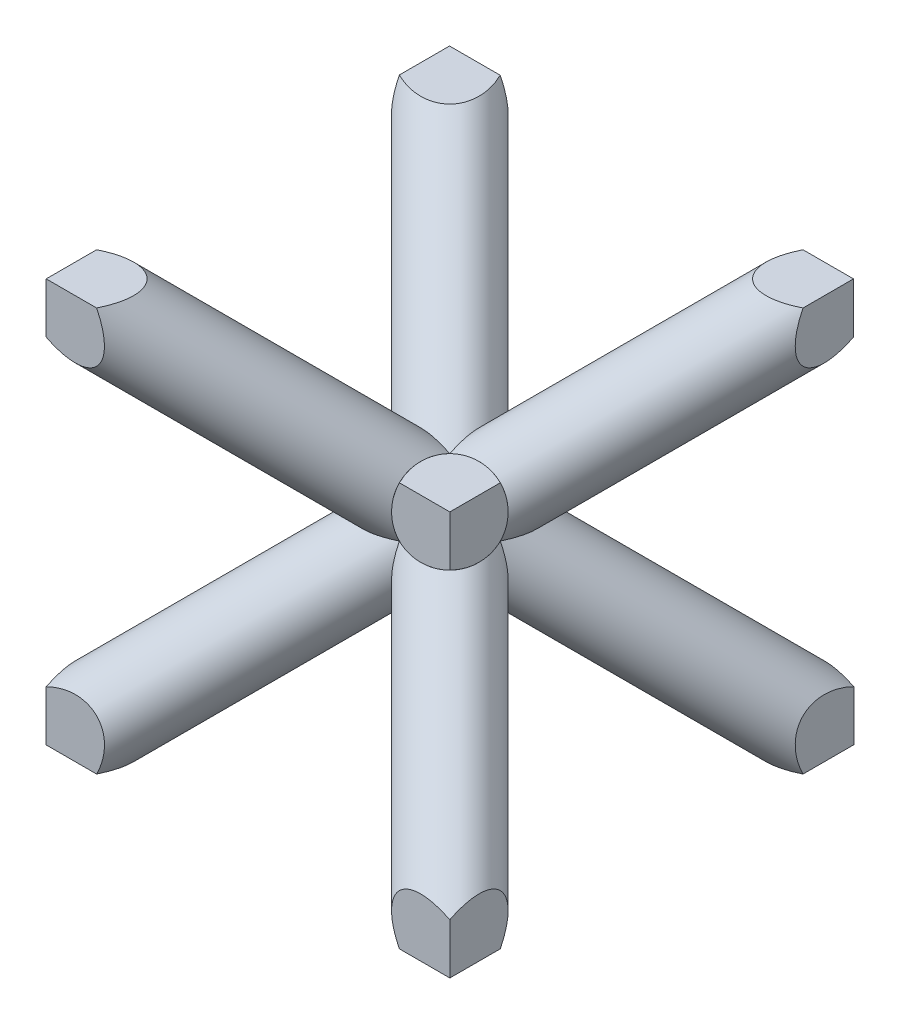
ISO-10303-21;
HEADER;
FILE_DESCRIPTION(('STEP AP214'),'2;1');
FILE_NAME('part.step','',(''),(''),'','','');
FILE_SCHEMA(('AUTOMOTIVE_DESIGN { 1 0 10303 214 1 1 1 1 }'));
ENDSEC;
DATA;
#1=APPLICATION_CONTEXT('core data for automotive mechanical design processes');
#2=APPLICATION_PROTOCOL_DEFINITION('international standard','automotive_design',2000,#1);
#3=PRODUCT_CONTEXT('',#1,'mechanical');
#4=PRODUCT('Part','Part','',(#3));
#5=PRODUCT_RELATED_PRODUCT_CATEGORY('part','',(#4));
#6=PRODUCT_DEFINITION_FORMATION('','',#4);
#7=PRODUCT_DEFINITION_CONTEXT('part definition',#1,'design');
#8=PRODUCT_DEFINITION('design','',#6,#7);
#9=PRODUCT_DEFINITION_SHAPE('','',#8);
#10=(LENGTH_UNIT() NAMED_UNIT(*) SI_UNIT(.MILLI.,.METRE.));
#11=(NAMED_UNIT(*) PLANE_ANGLE_UNIT() SI_UNIT($,.RADIAN.));
#12=(NAMED_UNIT(*) SI_UNIT($,.STERADIAN.) SOLID_ANGLE_UNIT());
#13=UNCERTAINTY_MEASURE_WITH_UNIT(LENGTH_MEASURE(1.E-05),#10,'distance_accuracy_value','');
#14=(GEOMETRIC_REPRESENTATION_CONTEXT(3) GLOBAL_UNCERTAINTY_ASSIGNED_CONTEXT((#13)) GLOBAL_UNIT_ASSIGNED_CONTEXT((#10,
#11,#12)) REPRESENTATION_CONTEXT('',''));
#15=CARTESIAN_POINT('',(0.,0.,0.));
#16=DIRECTION('',(0.,0.,1.));
#17=DIRECTION('',(1.,0.,0.));
#18=AXIS2_PLACEMENT_3D('',#15,#16,#17);
#19=CARTESIAN_POINT('',(-5.00010307764064,9.,0.));
#20=DIRECTION('',(0.,-1.,0.));
#21=DIRECTION('',(0.,0.,-1.));
#22=AXIS2_PLACEMENT_3D('',#19,#20,#21);
#23=PLANE('',#22);
#24=DIRECTION('',(0.999999672320654,0.,-0.000809542207574275));
#25=VECTOR('',#24,1.);
#26=CARTESIAN_POINT('',(-5.00333535670377,9.,-3.99272326227268));
#27=LINE('',#26,#25);
#28=CARTESIAN_POINT('',(2.99960122848684,9.,-3.99920197934588));
#29=VERTEX_POINT('',#28);
#30=CARTESIAN_POINT('',(3.99999999999999,9.,-4.0000118446412));
#31=VERTEX_POINT('',#30);
#32=EDGE_CURVE('E164',#29,#31,#27,.T.);
#33=ORIENTED_EDGE('',*,*,#32,.F.);
#34=CARTESIAN_POINT('',(3.99999999999998,9.,-3.99999999999998));
#35=DIRECTION('',(0.,1.,0.));
#36=DIRECTION('',(0.707106781186548,0.,-0.707106781186548));
#37=AXIS2_PLACEMENT_3D('',#34,#35,#36);
#38=ELLIPSE('',#37,1.41421356237307,0.816496580927711);
#39=CARTESIAN_POINT('',(4.,9.,-3.00000000000001));
#40=VERTEX_POINT('',#39);
#41=EDGE_CURVE('E183',#29,#40,#38,.T.);
#42=ORIENTED_EDGE('',*,*,#41,.T.);
#43=DIRECTION('',(0.,0.,1.));
#44=VECTOR('',#43,1.);
#45=CARTESIAN_POINT('',(3.99999999999999,8.99999999999999,-5.000025));
#46=LINE('',#45,#44);
#47=EDGE_CURVE('E122',#31,#40,#46,.T.);
#48=ORIENTED_EDGE('',*,*,#47,.F.);
#49=EDGE_LOOP('',(#33,#42,#48));
#50=FACE_BOUND('',#49,.T.);
#51=ADVANCED_FACE('F120',(#50),#23,.F.);
#52=CARTESIAN_POINT('',(-5.00010307764064,1.,0.));
#53=DIRECTION('',(0.,1.,0.));
#54=DIRECTION('',(0.,0.,1.));
#55=AXIS2_PLACEMENT_3D('',#52,#53,#54);
#56=PLANE('',#55);
#57=DIRECTION('',(-0.999999672320654,0.,0.000809542207574797));
#58=VECTOR('',#57,1.);
#59=CARTESIAN_POINT('',(-0.00324079879229594,1.,-4.00324739096831));
#60=LINE('',#59,#58);
#61=CARTESIAN_POINT('',(-2.99983716700637,1.00043199204134,-4.00049784205381));
#62=VERTEX_POINT('',#61);
#63=CARTESIAN_POINT('',(-4.,1.,-4.0000118446412));
#64=VERTEX_POINT('',#63);
#65=EDGE_CURVE('E523',#62,#64,#60,.T.);
#66=ORIENTED_EDGE('',*,*,#65,.F.);
#67=CARTESIAN_POINT('',(-4.00000000000001,0.999999999999999,-4.00000000000001));
#68=DIRECTION('',(0.,1.,0.));
#69=DIRECTION('',(-0.707106781186548,0.,-0.707106781186548));
#70=AXIS2_PLACEMENT_3D('',#67,#68,#69);
#71=ELLIPSE('',#70,1.4142135623731,0.816496580927728);
#72=CARTESIAN_POINT('',(-4.,1.,-3.));
#73=VERTEX_POINT('',#72);
#74=EDGE_CURVE('E272',#62,#73,#71,.F.);
#75=ORIENTED_EDGE('',*,*,#74,.T.);
#76=DIRECTION('',(0.,0.,1.));
#77=VECTOR('',#76,1.);
#78=CARTESIAN_POINT('',(-4.,1.,-5.000025));
#79=LINE('',#78,#77);
#80=EDGE_CURVE('E218',#64,#73,#79,.T.);
#81=ORIENTED_EDGE('',*,*,#80,.F.);
#82=EDGE_LOOP('',(#66,#75,#81));
#83=FACE_BOUND('',#82,.T.);
#84=ADVANCED_FACE('F489',(#83),#56,.F.);
#85=CARTESIAN_POINT('',(4.32692070451106,0.673079295488953,-4.32692070451106));
#86=DIRECTION('',(-0.577350269189626,0.577350269189626,0.577350269189626));
#87=DIRECTION('',(-0.707106781186548,-0.707106781186547,0.));
#88=AXIS2_PLACEMENT_3D('',#85,#86,#87);
#89=CYLINDRICAL_SURFACE('',#88,0.816496580927712);
#90=CARTESIAN_POINT('',(0.,5.00000000000002,0.));
#91=DIRECTION('',(0.,1.,0.));
#92=DIRECTION('',(-0.707106781186548,0.,0.707106781186547));
#93=AXIS2_PLACEMENT_3D('',#90,#91,#92);
#94=ELLIPSE('',#93,1.41421356237307,0.816496580927712);
#95=CARTESIAN_POINT('',(0.99999999999999,5.,0.));
#96=VERTEX_POINT('',#95);
#97=CARTESIAN_POINT('',(0.,5.,-0.999999999999998));
#98=VERTEX_POINT('',#97);
#99=EDGE_CURVE('E639',#96,#98,#94,.T.);
#100=ORIENTED_EDGE('',*,*,#99,.F.);
#101=CARTESIAN_POINT('',(0.,5.00000000000001,0.));
#102=DIRECTION('',(0.,0.,1.));
#103=DIRECTION('',(-0.707106781186547,0.707106781186548,0.));
#104=AXIS2_PLACEMENT_3D('',#101,#102,#103);
#105=ELLIPSE('',#104,1.41421356237309,0.81649658092772);
#106=CARTESIAN_POINT('',(0.,4.00000000000001,0.));
#107=VERTEX_POINT('',#106);
#108=EDGE_CURVE('E626',#96,#107,#105,.F.);
#109=ORIENTED_EDGE('',*,*,#108,.T.);
#110=CARTESIAN_POINT('',(0.,5.00000000000001,0.));
#111=DIRECTION('',(-1.,0.,0.));
#112=DIRECTION('',(0.,0.707106781186548,0.707106781186547));
#113=AXIS2_PLACEMENT_3D('',#110,#111,#112);
#114=ELLIPSE('',#113,1.41421356237308,0.81649658092772);
#115=EDGE_CURVE('E620',#107,#98,#114,.F.);
#116=ORIENTED_EDGE('',*,*,#115,.T.);
#117=EDGE_LOOP('',(#100,#109,#116));
#118=FACE_BOUND('',#117,.T.);
#119=CARTESIAN_POINT('',(4.,1.00000000000001,-4.));
#120=DIRECTION('',(1.,0.,0.));
#121=DIRECTION('',(0.,0.707106781186548,0.707106781186547));
#122=AXIS2_PLACEMENT_3D('',#119,#120,#121);
#123=ELLIPSE('',#122,1.41421356237307,0.816496580927712);
#124=CARTESIAN_POINT('',(3.99999999999999,1.99714742185702,-4.00568095123427));
#125=VERTEX_POINT('',#124);
#126=CARTESIAN_POINT('',(4.,1.,-3.00000000000002));
#127=VERTEX_POINT('',#126);
#128=EDGE_CURVE('E262',#125,#127,#123,.T.);
#129=ORIENTED_EDGE('',*,*,#128,.F.);
#130=CARTESIAN_POINT('',(4.00649870638162,0.993501293618386,-4.00649870638162));
#131=DIRECTION('',(-0.000809541942304187,0.000809541942304126,-0.999999344641629));
#132=DIRECTION('',(-0.707106317778199,0.707106317778199,0.0011448651941164));
#133=AXIS2_PLACEMENT_3D('',#130,#131,#132);
#134=ELLIPSE('',#133,1.41650793586478,0.816496580927712);
#135=CARTESIAN_POINT('',(3.00280491320505,1.00012981876958,-4.00566107221018));
#136=VERTEX_POINT('',#135);
#137=EDGE_CURVE('E528',#125,#136,#134,.F.);
#138=ORIENTED_EDGE('',*,*,#137,.T.);
#139=CARTESIAN_POINT('',(4.00000000000001,1.,-4.00000000000001));
#140=DIRECTION('',(0.,-1.,0.));
#141=DIRECTION('',(-0.707106781186548,0.,0.707106781186547));
#142=AXIS2_PLACEMENT_3D('',#139,#140,#141);
#143=ELLIPSE('',#142,1.41421356237307,0.816496580927712);
#144=EDGE_CURVE('E253',#127,#136,#143,.T.);
#145=ORIENTED_EDGE('',*,*,#144,.F.);
#146=EDGE_LOOP('',(#129,#138,#145));
#147=FACE_BOUND('',#146,.T.);
#148=ADVANCED_FACE('F118',(#118,#147),#89,.T.);
#149=CARTESIAN_POINT('',(-4.32692070451106,0.673079295488972,4.32692070451106));
#150=DIRECTION('',(0.577350269189626,0.577350269189625,-0.577350269189626));
#151=DIRECTION('',(-0.707106781186547,0.,-0.707106781186547));
#152=AXIS2_PLACEMENT_3D('',#149,#150,#151);
#153=CYLINDRICAL_SURFACE('',#152,0.816496580927711);
#154=CARTESIAN_POINT('',(0.,5.00000000000002,0.));
#155=DIRECTION('',(0.,0.,-1.));
#156=DIRECTION('',(-0.707106781186548,-0.707106781186547,0.));
#157=AXIS2_PLACEMENT_3D('',#154,#155,#156);
#158=ELLIPSE('',#157,1.41421356237308,0.816496580927719);
#159=CARTESIAN_POINT('',(0.,6.,0.));
#160=VERTEX_POINT('',#159);
#161=EDGE_CURVE('E217',#96,#160,#158,.F.);
#162=ORIENTED_EDGE('',*,*,#161,.F.);
#163=ORIENTED_EDGE('',*,*,#99,.T.);
#164=CARTESIAN_POINT('',(0.,5.00000000000001,0.));
#165=DIRECTION('',(1.,0.,0.));
#166=DIRECTION('',(0.,-0.707106781186547,0.707106781186548));
#167=AXIS2_PLACEMENT_3D('',#164,#165,#166);
#168=ELLIPSE('',#167,1.41421356237308,0.816496580927719);
#169=EDGE_CURVE('E226',#160,#98,#168,.F.);
#170=ORIENTED_EDGE('',*,*,#169,.F.);
#171=EDGE_LOOP('',(#162,#163,#170));
#172=FACE_BOUND('',#171,.T.);
#173=ORIENTED_EDGE('',*,*,#41,.F.);
#174=CARTESIAN_POINT('',(4.0000118446412,9.00001184464122,-4.0000118446412));
#175=DIRECTION('',(-0.000809541942304187,0.000809541942304126,-0.999999344641629));
#176=DIRECTION('',(0.7076789815169,0.706534117448227,-9.26816089267396E-07));
#177=AXIS2_PLACEMENT_3D('',#174,#175,#176);
#178=ELLIPSE('',#177,1.41421448919037,0.816496580927711);
#179=CARTESIAN_POINT('',(3.99999999999999,8.0004107800841,-4.00082105457012));
#180=VERTEX_POINT('',#179);
#181=EDGE_CURVE('E170',#29,#180,#178,.F.);
#182=ORIENTED_EDGE('',*,*,#181,.T.);
#183=CARTESIAN_POINT('',(4.,9.00000000000002,-4.));
#184=DIRECTION('',(1.,0.,0.));
#185=DIRECTION('',(0.,0.707106781186547,-0.707106781186548));
#186=AXIS2_PLACEMENT_3D('',#183,#184,#185);
#187=ELLIPSE('',#186,1.41421356237307,0.816496580927711);
#188=EDGE_CURVE('E179',#40,#180,#187,.T.);
#189=ORIENTED_EDGE('',*,*,#188,.F.);
#190=EDGE_LOOP('',(#173,#182,#189));
#191=FACE_BOUND('',#190,.T.);
#192=ADVANCED_FACE('F494',(#172,#191),#153,.T.);
#193=DIRECTION('',(-0.999999672320654,0.,0.000809542207574275));
#194=VECTOR('',#193,1.);
#195=CARTESIAN_POINT('',(-5.00334059957245,1.,-3.99919959781111));
#196=LINE('',#195,#194);
#197=CARTESIAN_POINT('',(4.,1.,-4.00648818442395));
#198=VERTEX_POINT('',#197);
#199=EDGE_CURVE('E185',#198,#136,#196,.T.);
#200=ORIENTED_EDGE('',*,*,#199,.F.);
#201=DIRECTION('',(0.,0.,1.));
#202=VECTOR('',#201,1.);
#203=CARTESIAN_POINT('',(4.,1.,0.));
#204=LINE('',#203,#202);
#205=EDGE_CURVE('E227',#198,#127,#204,.T.);
#206=ORIENTED_EDGE('',*,*,#205,.T.);
#207=ORIENTED_EDGE('',*,*,#144,.T.);
#208=EDGE_LOOP('',(#200,#206,#207));
#209=FACE_BOUND('',#208,.T.);
#210=ADVANCED_FACE('F481',(#209),#56,.F.);
#211=CARTESIAN_POINT('',(3.99999999999999,1.,-5.000025));
#212=DIRECTION('',(-1.,0.,0.));
#213=DIRECTION('',(0.,0.,1.));
#214=AXIS2_PLACEMENT_3D('',#211,#212,#213);
#215=PLANE('',#214);
#216=DIRECTION('',(0.,-0.999999672320654,-0.000809542207574214));
#217=VECTOR('',#216,1.);
#218=CARTESIAN_POINT('',(3.99999999999999,0.999195690276568,-4.00648883554684));
#219=LINE('',#218,#217);
#220=EDGE_CURVE('E139',#31,#180,#219,.T.);
#221=ORIENTED_EDGE('',*,*,#220,.F.);
#222=ORIENTED_EDGE('',*,*,#47,.T.);
#223=ORIENTED_EDGE('',*,*,#188,.T.);
#224=EDGE_LOOP('',(#221,#222,#223));
#225=FACE_BOUND('',#224,.T.);
#226=ADVANCED_FACE('F178',(#225),#215,.F.);
#227=CARTESIAN_POINT('',(-4.,9.,-5.000025));
#228=DIRECTION('',(1.,0.,0.));
#229=DIRECTION('',(0.,1.,0.));
#230=AXIS2_PLACEMENT_3D('',#227,#228,#229);
#231=PLANE('',#230);
#232=DIRECTION('',(0.,0.999999672320654,0.000809542207574186));
#233=VECTOR('',#232,1.);
#234=CARTESIAN_POINT('',(-4.,0.00323883271653579,-4.0008187651414));
#235=LINE('',#234,#233);
#236=CARTESIAN_POINT('',(-4.,2.00039877151318,-3.99920197934588));
#237=VERTEX_POINT('',#236);
#238=EDGE_CURVE('E173',#64,#237,#235,.T.);
#239=ORIENTED_EDGE('',*,*,#238,.F.);
#240=ORIENTED_EDGE('',*,*,#80,.T.);
#241=CARTESIAN_POINT('',(-4.,1.00000000000001,-4.));
#242=DIRECTION('',(-1.,0.,0.));
#243=DIRECTION('',(0.,-0.707106781186547,-0.707106781186548));
#244=AXIS2_PLACEMENT_3D('',#241,#242,#243);
#245=ELLIPSE('',#244,1.4142135623731,0.816496580927728);
#246=EDGE_CURVE('E278',#237,#73,#245,.F.);
#247=ORIENTED_EDGE('',*,*,#246,.F.);
#248=EDGE_LOOP('',(#239,#240,#247));
#249=FACE_BOUND('',#248,.T.);
#250=ADVANCED_FACE('F483',(#249),#231,.F.);
#251=DIRECTION('',(0.,-0.999999672320654,-0.000809542207574214));
#252=VECTOR('',#251,1.);
#253=CARTESIAN_POINT('',(3.99999999999999,0.999195690276568,-4.00648883554684));
#254=LINE('',#253,#252);
#255=EDGE_CURVE('E127',#125,#198,#254,.T.);
#256=ORIENTED_EDGE('',*,*,#255,.F.);
#257=ORIENTED_EDGE('',*,*,#128,.T.);
#258=ORIENTED_EDGE('',*,*,#205,.F.);
#259=EDGE_LOOP('',(#256,#257,#258));
#260=FACE_BOUND('',#259,.T.);
#261=ADVANCED_FACE('F488',(#260),#215,.F.);
#262=DIRECTION('',(1.,0.,0.));
#263=VECTOR('',#262,1.);
#264=CARTESIAN_POINT('',(-2.8452994616208,1.,4.));
#265=LINE('',#264,#263);
#266=CARTESIAN_POINT('',(-4.,1.,4.));
#267=VERTEX_POINT('',#266);
#268=CARTESIAN_POINT('',(-3.00000000000003,1.,4.));
#269=VERTEX_POINT('',#268);
#270=EDGE_CURVE('E433',#267,#269,#265,.T.);
#271=ORIENTED_EDGE('',*,*,#270,.F.);
#272=DIRECTION('',(0.,0.,1.));
#273=VECTOR('',#272,1.);
#274=CARTESIAN_POINT('',(-4.,1.,-5.000025));
#275=LINE('',#274,#273);
#276=CARTESIAN_POINT('',(-4.,1.,3.00000000000003));
#277=VERTEX_POINT('',#276);
#278=EDGE_CURVE('E193',#277,#267,#275,.T.);
#279=ORIENTED_EDGE('',*,*,#278,.F.);
#280=CARTESIAN_POINT('',(-4.00000000000003,1.,4.00000000000003));
#281=DIRECTION('',(0.,1.,0.));
#282=DIRECTION('',(0.707106781186548,0.,-0.707106781186548));
#283=AXIS2_PLACEMENT_3D('',#280,#281,#282);
#284=ELLIPSE('',#283,1.41421356237307,0.816496580927711);
#285=EDGE_CURVE('E431',#269,#277,#284,.T.);
#286=ORIENTED_EDGE('',*,*,#285,.F.);
#287=EDGE_LOOP('',(#271,#279,#286));
#288=FACE_BOUND('',#287,.T.);
#289=ADVANCED_FACE('F427',(#288),#56,.F.);
#290=DIRECTION('',(-1.,0.,0.));
#291=VECTOR('',#290,1.);
#292=CARTESIAN_POINT('',(4.,9.,4.));
#293=LINE('',#292,#291);
#294=CARTESIAN_POINT('',(4.,9.,4.));
#295=VERTEX_POINT('',#294);
#296=CARTESIAN_POINT('',(3.,9.,4.));
#297=VERTEX_POINT('',#296);
#298=EDGE_CURVE('E402',#295,#297,#293,.T.);
#299=ORIENTED_EDGE('',*,*,#298,.F.);
#300=DIRECTION('',(0.,0.,1.));
#301=VECTOR('',#300,1.);
#302=CARTESIAN_POINT('',(3.99999999999999,8.99999999999999,-5.000025));
#303=LINE('',#302,#301);
#304=CARTESIAN_POINT('',(3.99999999999999,8.99999999999999,2.99999999999999));
#305=VERTEX_POINT('',#304);
#306=EDGE_CURVE('E190',#305,#295,#303,.T.);
#307=ORIENTED_EDGE('',*,*,#306,.F.);
#308=CARTESIAN_POINT('',(4.,9.,4.));
#309=DIRECTION('',(0.,-1.,0.));
#310=DIRECTION('',(-0.707106781186548,0.,-0.707106781186548));
#311=AXIS2_PLACEMENT_3D('',#308,#309,#310);
#312=ELLIPSE('',#311,1.4142135623731,0.816496580927728);
#313=EDGE_CURVE('E256',#305,#297,#312,.F.);
#314=ORIENTED_EDGE('',*,*,#313,.T.);
#315=EDGE_LOOP('',(#299,#307,#314));
#316=FACE_BOUND('',#315,.T.);
#317=ADVANCED_FACE('F493',(#316),#23,.F.);
#318=CARTESIAN_POINT('',(4.32692070451105,9.32692070451106,4.32692070451105));
#319=DIRECTION('',(-0.577350269189626,-0.577350269189626,-0.577350269189626));
#320=DIRECTION('',(-0.707106781186548,0.,0.707106781186548));
#321=AXIS2_PLACEMENT_3D('',#318,#319,#320);
#322=CYLINDRICAL_SURFACE('',#321,0.816496580927728);
#323=CARTESIAN_POINT('',(0.,5.,0.));
#324=DIRECTION('',(0.,-1.,0.));
#325=DIRECTION('',(-0.707106781186548,0.,-0.707106781186548));
#326=AXIS2_PLACEMENT_3D('',#323,#324,#325);
#327=ELLIPSE('',#326,1.4142135623731,0.816496580927728);
#328=CARTESIAN_POINT('',(0.,5.,0.999999999999997));
#329=VERTEX_POINT('',#328);
#330=EDGE_CURVE('E618',#96,#329,#327,.T.);
#331=ORIENTED_EDGE('',*,*,#330,.F.);
#332=ORIENTED_EDGE('',*,*,#161,.T.);
#333=CARTESIAN_POINT('',(0.,5.00000000000001,0.));
#334=DIRECTION('',(-1.,0.,0.));
#335=DIRECTION('',(0.,0.707106781186548,0.707106781186547));
#336=AXIS2_PLACEMENT_3D('',#333,#334,#335);
#337=ELLIPSE('',#336,1.41421356237308,0.81649658092772);
#338=EDGE_CURVE('E269',#329,#160,#337,.T.);
#339=ORIENTED_EDGE('',*,*,#338,.F.);
#340=EDGE_LOOP('',(#331,#332,#339));
#341=FACE_BOUND('',#340,.T.);
#342=CARTESIAN_POINT('',(4.,9.,4.));
#343=DIRECTION('',(0.,0.,1.));
#344=DIRECTION('',(-0.707106781186548,-0.707106781186547,0.));
#345=AXIS2_PLACEMENT_3D('',#342,#343,#344);
#346=ELLIPSE('',#345,1.4142135623731,0.816496580927728);
#347=CARTESIAN_POINT('',(4.,8.,4.));
#348=VERTEX_POINT('',#347);
#349=EDGE_CURVE('E195',#297,#348,#346,.T.);
#350=ORIENTED_EDGE('',*,*,#349,.F.);
#351=ORIENTED_EDGE('',*,*,#313,.F.);
#352=CARTESIAN_POINT('',(4.,9.,4.));
#353=DIRECTION('',(1.,0.,0.));
#354=DIRECTION('',(0.,-0.707106781186547,-0.707106781186548));
#355=AXIS2_PLACEMENT_3D('',#352,#353,#354);
#356=ELLIPSE('',#355,1.4142135623731,0.816496580927728);
#357=EDGE_CURVE('E273',#305,#348,#356,.F.);
#358=ORIENTED_EDGE('',*,*,#357,.T.);
#359=EDGE_LOOP('',(#350,#351,#358));
#360=FACE_BOUND('',#359,.T.);
#361=ADVANCED_FACE('F501',(#341,#360),#322,.T.);
#362=CARTESIAN_POINT('',(-4.32692070451105,9.32692070451106,-4.32692070451105));
#363=DIRECTION('',(0.577350269189626,-0.577350269189626,0.577350269189626));
#364=DIRECTION('',(0.707106781186548,0.,-0.707106781186548));
#365=AXIS2_PLACEMENT_3D('',#362,#363,#364);
#366=CYLINDRICAL_SURFACE('',#365,0.816496580927728);
#367=ORIENTED_EDGE('',*,*,#330,.T.);
#368=CARTESIAN_POINT('',(0.,5.00000000000001,0.));
#369=DIRECTION('',(1.,0.,0.));
#370=DIRECTION('',(0.,-0.707106781186547,0.707106781186548));
#371=AXIS2_PLACEMENT_3D('',#368,#369,#370);
#372=ELLIPSE('',#371,1.41421356237308,0.816496580927719);
#373=EDGE_CURVE('E621',#329,#107,#372,.T.);
#374=ORIENTED_EDGE('',*,*,#373,.T.);
#375=ORIENTED_EDGE('',*,*,#108,.F.);
#376=EDGE_LOOP('',(#367,#374,#375));
#377=FACE_BOUND('',#376,.T.);
#378=CARTESIAN_POINT('',(4.,1.00000000000001,4.));
#379=DIRECTION('',(0.,0.,1.));
#380=DIRECTION('',(0.707106781186548,-0.707106781186547,0.));
#381=AXIS2_PLACEMENT_3D('',#378,#379,#380);
#382=ELLIPSE('',#381,1.4142135623731,0.816496580927728);
#383=CARTESIAN_POINT('',(4.,2.00000000000001,4.));
#384=VERTEX_POINT('',#383);
#385=CARTESIAN_POINT('',(3.,1.,4.));
#386=VERTEX_POINT('',#385);
#387=EDGE_CURVE('E202',#384,#386,#382,.T.);
#388=ORIENTED_EDGE('',*,*,#387,.F.);
#389=CARTESIAN_POINT('',(4.,1.00000000000001,4.));
#390=DIRECTION('',(1.,0.,0.));
#391=DIRECTION('',(0.,-0.707106781186547,0.707106781186548));
#392=AXIS2_PLACEMENT_3D('',#389,#390,#391);
#393=ELLIPSE('',#392,1.4142135623731,0.816496580927728);
#394=CARTESIAN_POINT('',(4.,1.,3.));
#395=VERTEX_POINT('',#394);
#396=EDGE_CURVE('E229',#384,#395,#393,.F.);
#397=ORIENTED_EDGE('',*,*,#396,.T.);
#398=CARTESIAN_POINT('',(4.00000000000001,0.999999999999999,4.00000000000001));
#399=DIRECTION('',(0.,1.,0.));
#400=DIRECTION('',(0.707106781186548,0.,0.707106781186548));
#401=AXIS2_PLACEMENT_3D('',#398,#399,#400);
#402=ELLIPSE('',#401,1.4142135623731,0.816496580927728);
#403=EDGE_CURVE('E232',#386,#395,#402,.F.);
#404=ORIENTED_EDGE('',*,*,#403,.F.);
#405=EDGE_LOOP('',(#388,#397,#404));
#406=FACE_BOUND('',#405,.T.);
#407=ADVANCED_FACE('F399',(#377,#406),#366,.T.);
#408=DIRECTION('',(1.,0.,0.));
#409=VECTOR('',#408,1.);
#410=CARTESIAN_POINT('',(2.8452994616208,1.,4.));
#411=LINE('',#410,#409);
#412=CARTESIAN_POINT('',(4.,1.,4.));
#413=VERTEX_POINT('',#412);
#414=EDGE_CURVE('E384',#386,#413,#411,.T.);
#415=ORIENTED_EDGE('',*,*,#414,.F.);
#416=ORIENTED_EDGE('',*,*,#403,.T.);
#417=DIRECTION('',(0.,0.,1.));
#418=VECTOR('',#417,1.);
#419=CARTESIAN_POINT('',(3.99999999999999,1.,-5.000025));
#420=LINE('',#419,#418);
#421=EDGE_CURVE('E187',#395,#413,#420,.T.);
#422=ORIENTED_EDGE('',*,*,#421,.T.);
#423=EDGE_LOOP('',(#415,#416,#422));
#424=FACE_BOUND('',#423,.T.);
#425=ADVANCED_FACE('F395',(#424),#56,.F.);
#426=DIRECTION('',(-1.,0.,0.));
#427=VECTOR('',#426,1.);
#428=CARTESIAN_POINT('',(-4.,9.,4.));
#429=LINE('',#428,#427);
#430=CARTESIAN_POINT('',(-3.00000000000001,9.,4.));
#431=VERTEX_POINT('',#430);
#432=CARTESIAN_POINT('',(-4.,9.,4.));
#433=VERTEX_POINT('',#432);
#434=EDGE_CURVE('E436',#431,#433,#429,.T.);
#435=ORIENTED_EDGE('',*,*,#434,.F.);
#436=CARTESIAN_POINT('',(-3.99999999999998,9.,3.99999999999998));
#437=DIRECTION('',(0.,1.,0.));
#438=DIRECTION('',(-0.707106781186548,0.,0.707106781186547));
#439=AXIS2_PLACEMENT_3D('',#436,#437,#438);
#440=ELLIPSE('',#439,1.41421356237307,0.816496580927712);
#441=CARTESIAN_POINT('',(-4.,9.,3.00000000000001));
#442=VERTEX_POINT('',#441);
#443=EDGE_CURVE('E240',#431,#442,#440,.T.);
#444=ORIENTED_EDGE('',*,*,#443,.T.);
#445=DIRECTION('',(0.,0.,1.));
#446=VECTOR('',#445,1.);
#447=CARTESIAN_POINT('',(-4.,9.,-5.000025));
#448=LINE('',#447,#446);
#449=EDGE_CURVE('E224',#442,#433,#448,.T.);
#450=ORIENTED_EDGE('',*,*,#449,.T.);
#451=EDGE_LOOP('',(#435,#444,#450));
#452=FACE_BOUND('',#451,.T.);
#453=ADVANCED_FACE('F577',(#452),#23,.F.);
#454=DIRECTION('',(0.,-1.,0.));
#455=VECTOR('',#454,1.);
#456=CARTESIAN_POINT('',(-4.,1.,4.));
#457=LINE('',#456,#455);
#458=CARTESIAN_POINT('',(-4.,2.00000000000001,4.));
#459=VERTEX_POINT('',#458);
#460=EDGE_CURVE('E394',#459,#267,#457,.T.);
#461=ORIENTED_EDGE('',*,*,#460,.F.);
#462=CARTESIAN_POINT('',(-4.,1.00000000000003,4.));
#463=DIRECTION('',(-1.,0.,0.));
#464=DIRECTION('',(0.,0.707106781186547,-0.707106781186548));
#465=AXIS2_PLACEMENT_3D('',#462,#463,#464);
#466=ELLIPSE('',#465,1.41421356237307,0.816496580927711);
#467=EDGE_CURVE('E428',#459,#277,#466,.T.);
#468=ORIENTED_EDGE('',*,*,#467,.T.);
#469=ORIENTED_EDGE('',*,*,#278,.T.);
#470=EDGE_LOOP('',(#461,#468,#469));
#471=FACE_BOUND('',#470,.T.);
#472=ADVANCED_FACE('F421',(#471),#231,.F.);
#473=DIRECTION('',(0.,1.,0.));
#474=VECTOR('',#473,1.);
#475=CARTESIAN_POINT('',(4.,1.,4.));
#476=LINE('',#475,#474);
#477=EDGE_CURVE('E383',#413,#384,#476,.T.);
#478=ORIENTED_EDGE('',*,*,#477,.F.);
#479=ORIENTED_EDGE('',*,*,#421,.F.);
#480=ORIENTED_EDGE('',*,*,#396,.F.);
#481=EDGE_LOOP('',(#478,#479,#480));
#482=FACE_BOUND('',#481,.T.);
#483=ADVANCED_FACE('F400',(#482),#215,.F.);
#484=EDGE_CURVE('E270',#348,#295,#476,.T.);
#485=ORIENTED_EDGE('',*,*,#484,.F.);
#486=ORIENTED_EDGE('',*,*,#357,.F.);
#487=ORIENTED_EDGE('',*,*,#306,.T.);
#488=EDGE_LOOP('',(#485,#486,#487));
#489=FACE_BOUND('',#488,.T.);
#490=ADVANCED_FACE('F487',(#489),#215,.F.);
#491=CARTESIAN_POINT('',(-4.,8.00000000000003,4.));
#492=VERTEX_POINT('',#491);
#493=EDGE_CURVE('E440',#433,#492,#457,.T.);
#494=ORIENTED_EDGE('',*,*,#493,.F.);
#495=ORIENTED_EDGE('',*,*,#449,.F.);
#496=CARTESIAN_POINT('',(-4.,9.00000000000002,4.));
#497=DIRECTION('',(-1.,0.,0.));
#498=DIRECTION('',(0.,0.707106781186548,0.707106781186547));
#499=AXIS2_PLACEMENT_3D('',#496,#497,#498);
#500=ELLIPSE('',#499,1.41421356237307,0.816496580927712);
#501=EDGE_CURVE('E260',#442,#492,#500,.T.);
#502=ORIENTED_EDGE('',*,*,#501,.T.);
#503=EDGE_LOOP('',(#494,#495,#502));
#504=FACE_BOUND('',#503,.T.);
#505=ADVANCED_FACE('F484',(#504),#231,.F.);
#506=CARTESIAN_POINT('',(-4.,9.00000000000002,4.));
#507=DIRECTION('',(0.,0.,-1.));
#508=DIRECTION('',(-0.707106781186547,0.707106781186548,0.));
#509=AXIS2_PLACEMENT_3D('',#506,#507,#508);
#510=ELLIPSE('',#509,1.41421356237307,0.816496580927712);
#511=EDGE_CURVE('E386',#492,#431,#510,.F.);
#512=ORIENTED_EDGE('',*,*,#511,.F.);
#513=ORIENTED_EDGE('',*,*,#501,.F.);
#514=ORIENTED_EDGE('',*,*,#443,.F.);
#515=EDGE_LOOP('',(#512,#513,#514));
#516=FACE_BOUND('',#515,.T.);
#517=CARTESIAN_POINT('',(0.,5.00000000000002,0.));
#518=DIRECTION('',(0.,1.,0.));
#519=DIRECTION('',(-0.707106781186548,0.,0.707106781186547));
#520=AXIS2_PLACEMENT_3D('',#517,#518,#519);
#521=ELLIPSE('',#520,1.41421356237307,0.816496580927712);
#522=CARTESIAN_POINT('',(-0.999999999999997,5.,0.));
#523=VERTEX_POINT('',#522);
#524=EDGE_CURVE('E602',#329,#523,#521,.F.);
#525=ORIENTED_EDGE('',*,*,#524,.F.);
#526=ORIENTED_EDGE('',*,*,#338,.T.);
#527=CARTESIAN_POINT('',(0.,5.00000000000001,0.));
#528=DIRECTION('',(0.,0.,1.));
#529=DIRECTION('',(-0.707106781186547,0.707106781186548,0.));
#530=AXIS2_PLACEMENT_3D('',#527,#528,#529);
#531=ELLIPSE('',#530,1.41421356237309,0.81649658092772);
#532=EDGE_CURVE('E236',#160,#523,#531,.T.);
#533=ORIENTED_EDGE('',*,*,#532,.T.);
#534=EDGE_LOOP('',(#525,#526,#533));
#535=FACE_BOUND('',#534,.T.);
#536=ADVANCED_FACE('F582',(#516,#535),#89,.T.);
#537=ORIENTED_EDGE('',*,*,#74,.F.);
#538=CARTESIAN_POINT('',(-4.0000118446412,0.999988155358808,-4.0000118446412));
#539=DIRECTION('',(0.000809541942304709,-0.000809541942304098,0.999999344641629));
#540=DIRECTION('',(-0.706534117448227,-0.707678981516899,-9.26816088791431E-07));
#541=AXIS2_PLACEMENT_3D('',#538,#539,#540);
#542=ELLIPSE('',#541,1.4142144891904,0.816496580927728);
#543=CARTESIAN_POINT('',(-2.85083022938074,1.48154909551441,-4.00055231193345));
#544=VERTEX_POINT('',#543);
#545=EDGE_CURVE('E546',#62,#544,#542,.T.);
#546=ORIENTED_EDGE('',*,*,#545,.T.);
#547=CARTESIAN_POINT('',(-2.85076971803935,1.66801051021194,-4.0004014124852));
#548=DIRECTION('',(-0.000324524612673398,-0.999999619875203,-0.000809279448664072));
#549=VECTOR('',#548,1.);
#550=LINE('',#547,#549);
#551=CARTESIAN_POINT('',(-2.85076971803935,1.66801051021194,-4.0004014124852));
#552=VERTEX_POINT('',#551);
#553=EDGE_CURVE('E404',#552,#544,#550,.T.);
#554=ORIENTED_EDGE('',*,*,#553,.F.);
#555=EDGE_CURVE('E549',#552,#237,#542,.T.);
#556=ORIENTED_EDGE('',*,*,#555,.T.);
#557=ORIENTED_EDGE('',*,*,#246,.T.);
#558=EDGE_LOOP('',(#537,#546,#554,#556,#557));
#559=FACE_BOUND('',#558,.T.);
#560=ORIENTED_EDGE('',*,*,#115,.F.);
#561=CARTESIAN_POINT('',(0.,5.00000000000002,0.));
#562=DIRECTION('',(0.,0.,-1.));
#563=DIRECTION('',(-0.707106781186548,-0.707106781186547,0.));
#564=AXIS2_PLACEMENT_3D('',#561,#562,#563);
#565=ELLIPSE('',#564,1.41421356237308,0.816496580927719);
#566=EDGE_CURVE('E609',#107,#523,#565,.T.);
#567=ORIENTED_EDGE('',*,*,#566,.T.);
#568=CARTESIAN_POINT('',(0.,5.,0.));
#569=DIRECTION('',(0.,-1.,0.));
#570=DIRECTION('',(-0.707106781186548,0.,-0.707106781186548));
#571=AXIS2_PLACEMENT_3D('',#568,#569,#570);
#572=ELLIPSE('',#571,1.4142135623731,0.816496580927728);
#573=EDGE_CURVE('E650',#98,#523,#572,.F.);
#574=ORIENTED_EDGE('',*,*,#573,.F.);
#575=EDGE_LOOP('',(#560,#567,#574));
#576=FACE_BOUND('',#575,.T.);
#577=ADVANCED_FACE('F499',(#559,#576),#322,.T.);
#578=CARTESIAN_POINT('',(-2.8478349084337,7.8478349084337,-2.8478349084337));
#579=DIRECTION('',(0.999999619662737,-0.000323869254337822,-0.000809804350862433));
#580=DIRECTION('',(0.0003440621184427,-0.706706104030464,0.707507147771202));
#581=AXIS2_PLACEMENT_3D('',#578,#579,#580);
#582=ELLIPSE('',#581,1.41490165088321,0.816496580927728);
#583=CARTESIAN_POINT('',(-2.84861674345508,8.30224927604832,-3.99503245735363));
#584=VERTEX_POINT('',#583);
#585=CARTESIAN_POINT('',(-2.84853890692405,8.54209703613863,-3.9948383534168));
#586=VERTEX_POINT('',#585);
#587=EDGE_CURVE('E13',#584,#586,#582,.T.);
#588=ORIENTED_EDGE('',*,*,#587,.T.);
#589=CARTESIAN_POINT('',(-3.99354595450634,8.99354595450634,-3.99354595450634));
#590=DIRECTION('',(0.000809541942304709,-0.000809541942304098,0.999999344641629));
#591=DIRECTION('',(0.707106317778199,-0.707106317778199,-0.00114486519411675));
#592=AXIS2_PLACEMENT_3D('',#589,#590,#591);
#593=ELLIPSE('',#592,1.41192845708115,0.816496580927728);
#594=CARTESIAN_POINT('',(-2.99718564517996,9.00000000000001,-3.99434732567105));
#595=VERTEX_POINT('',#594);
#596=EDGE_CURVE('E548',#586,#595,#593,.T.);
#597=ORIENTED_EDGE('',*,*,#596,.T.);
#598=CARTESIAN_POINT('',(-4.,9.,-4.));
#599=DIRECTION('',(0.,-1.,0.));
#600=DIRECTION('',(0.707106781186548,0.,0.707106781186548));
#601=AXIS2_PLACEMENT_3D('',#598,#599,#600);
#602=ELLIPSE('',#601,1.4142135623731,0.816496580927728);
#603=CARTESIAN_POINT('',(-4.,9.,-3.));
#604=VERTEX_POINT('',#603);
#605=EDGE_CURVE('E252',#604,#595,#602,.F.);
#606=ORIENTED_EDGE('',*,*,#605,.F.);
#607=CARTESIAN_POINT('',(-4.,9.,-4.));
#608=DIRECTION('',(-1.,0.,0.));
#609=DIRECTION('',(0.,-0.707106781186547,0.707106781186548));
#610=AXIS2_PLACEMENT_3D('',#607,#608,#609);
#611=ELLIPSE('',#610,1.4142135623731,0.816496580927728);
#612=CARTESIAN_POINT('',(-4.,7.99718564517996,-3.99434732567105));
#613=VERTEX_POINT('',#612);
#614=EDGE_CURVE('E246',#604,#613,#611,.F.);
#615=ORIENTED_EDGE('',*,*,#614,.T.);
#616=EDGE_CURVE('E296',#613,#584,#593,.T.);
#617=ORIENTED_EDGE('',*,*,#616,.T.);
#618=EDGE_LOOP('',(#588,#597,#606,#615,#617));
#619=FACE_BOUND('',#618,.T.);
#620=ORIENTED_EDGE('',*,*,#532,.F.);
#621=ORIENTED_EDGE('',*,*,#169,.T.);
#622=ORIENTED_EDGE('',*,*,#573,.T.);
#623=EDGE_LOOP('',(#620,#621,#622));
#624=FACE_BOUND('',#623,.T.);
#625=ADVANCED_FACE('F294',(#619,#624),#366,.T.);
#626=CARTESIAN_POINT('',(-4.,1.00000000000003,4.));
#627=DIRECTION('',(0.,0.,-1.));
#628=DIRECTION('',(0.707106781186548,0.707106781186547,0.));
#629=AXIS2_PLACEMENT_3D('',#626,#627,#628);
#630=ELLIPSE('',#629,1.41421356237307,0.816496580927711);
#631=EDGE_CURVE('E445',#269,#459,#630,.F.);
#632=ORIENTED_EDGE('',*,*,#631,.F.);
#633=ORIENTED_EDGE('',*,*,#285,.T.);
#634=ORIENTED_EDGE('',*,*,#467,.F.);
#635=EDGE_LOOP('',(#632,#633,#634));
#636=FACE_BOUND('',#635,.T.);
#637=ORIENTED_EDGE('',*,*,#373,.F.);
#638=ORIENTED_EDGE('',*,*,#524,.T.);
#639=ORIENTED_EDGE('',*,*,#566,.F.);
#640=EDGE_LOOP('',(#637,#638,#639));
#641=FACE_BOUND('',#640,.T.);
#642=ADVANCED_FACE('F498',(#636,#641),#153,.T.);
#643=ORIENTED_EDGE('',*,*,#605,.T.);
#644=DIRECTION('',(0.999999672320654,0.,-0.000809542207574797));
#645=VECTOR('',#644,1.);
#646=CARTESIAN_POINT('',(-0.00323555592360919,9.00000000000001,-3.99677105542988));
#647=LINE('',#646,#645);
#648=CARTESIAN_POINT('',(-4.,9.00000000000001,-3.99353550485844));
#649=VERTEX_POINT('',#648);
#650=EDGE_CURVE('E346',#649,#595,#647,.T.);
#651=ORIENTED_EDGE('',*,*,#650,.F.);
#652=EDGE_CURVE('E215',#649,#604,#448,.T.);
#653=ORIENTED_EDGE('',*,*,#652,.T.);
#654=EDGE_LOOP('',(#643,#651,#653));
#655=FACE_BOUND('',#654,.T.);
#656=ADVANCED_FACE('F479',(#655),#23,.F.);
#657=ORIENTED_EDGE('',*,*,#652,.F.);
#658=DIRECTION('',(0.,-0.999999672320654,-0.000809542207574186));
#659=VECTOR('',#658,1.);
#660=CARTESIAN_POINT('',(-4.,8.9991852045392,-3.99353616446997));
#661=LINE('',#660,#659);
#662=EDGE_CURVE('E310',#649,#613,#661,.T.);
#663=ORIENTED_EDGE('',*,*,#662,.T.);
#664=ORIENTED_EDGE('',*,*,#614,.F.);
#665=EDGE_LOOP('',(#657,#663,#664));
#666=FACE_BOUND('',#665,.T.);
#667=ADVANCED_FACE('F302',(#666),#231,.F.);
#668=CARTESIAN_POINT('',(0.,0.,4.));
#669=DIRECTION('',(0.,0.,-1.));
#670=DIRECTION('',(-1.,0.,0.));
#671=AXIS2_PLACEMENT_3D('',#668,#669,#670);
#672=PLANE('',#671);
#673=ORIENTED_EDGE('',*,*,#270,.T.);
#674=ORIENTED_EDGE('',*,*,#631,.T.);
#675=ORIENTED_EDGE('',*,*,#460,.T.);
#676=EDGE_LOOP('',(#673,#674,#675));
#677=FACE_BOUND('',#676,.T.);
#678=ADVANCED_FACE('F474',(#677),#672,.F.);
#679=CARTESIAN_POINT('',(0.,0.,4.));
#680=DIRECTION('',(0.,0.,1.));
#681=DIRECTION('',(1.,0.,0.));
#682=AXIS2_PLACEMENT_3D('',#679,#680,#681);
#683=PLANE('',#682);
#684=ORIENTED_EDGE('',*,*,#387,.T.);
#685=ORIENTED_EDGE('',*,*,#414,.T.);
#686=ORIENTED_EDGE('',*,*,#477,.T.);
#687=EDGE_LOOP('',(#684,#685,#686));
#688=FACE_BOUND('',#687,.T.);
#689=ADVANCED_FACE('F385',(#688),#683,.T.);
#690=ORIENTED_EDGE('',*,*,#349,.T.);
#691=ORIENTED_EDGE('',*,*,#484,.T.);
#692=ORIENTED_EDGE('',*,*,#298,.T.);
#693=EDGE_LOOP('',(#690,#691,#692));
#694=FACE_BOUND('',#693,.T.);
#695=ADVANCED_FACE('F471',(#694),#683,.T.);
#696=ORIENTED_EDGE('',*,*,#511,.T.);
#697=ORIENTED_EDGE('',*,*,#434,.T.);
#698=ORIENTED_EDGE('',*,*,#493,.T.);
#699=EDGE_LOOP('',(#696,#697,#698));
#700=FACE_BOUND('',#699,.T.);
#701=ADVANCED_FACE('F468',(#700),#672,.F.);
#702=CARTESIAN_POINT('',(-0.00324145202656576,0.00324145202656545,-4.00405430881924));
#703=DIRECTION('',(-0.000809541942304187,0.000809541942304126,-0.999999344641629));
#704=DIRECTION('',(-0.999999672320654,0.,0.000809542207574275));
#705=AXIS2_PLACEMENT_3D('',#702,#703,#704);
#706=PLANE('',#705);
#707=ORIENTED_EDGE('',*,*,#255,.T.);
#708=ORIENTED_EDGE('',*,*,#199,.T.);
#709=ORIENTED_EDGE('',*,*,#137,.F.);
#710=EDGE_LOOP('',(#707,#708,#709));
#711=FACE_BOUND('',#710,.T.);
#712=ADVANCED_FACE('F470',(#711),#706,.T.);
#713=CARTESIAN_POINT('',(-0.00324145202656837,0.00324145202656531,-4.00405430881925));
#714=DIRECTION('',(0.000809541942304709,-0.000809541942304098,0.999999344641629));
#715=DIRECTION('',(0.999999672320654,0.,-0.000809542207574797));
#716=AXIS2_PLACEMENT_3D('',#713,#714,#715);
#717=PLANE('',#716);
#718=DIRECTION('',(-0.000324524612674478,-0.999999619875202,-0.000809279448659985));
#719=VECTOR('',#718,1.);
#720=CARTESIAN_POINT('',(-2.85098605151023,1.00139423460979,-4.00094089154226));
#721=LINE('',#720,#719);
#722=EDGE_CURVE('E519',#586,#584,#721,.T.);
#723=ORIENTED_EDGE('',*,*,#722,.T.);
#724=ORIENTED_EDGE('',*,*,#616,.F.);
#725=ORIENTED_EDGE('',*,*,#662,.F.);
#726=ORIENTED_EDGE('',*,*,#650,.T.);
#727=ORIENTED_EDGE('',*,*,#596,.F.);
#728=EDGE_LOOP('',(#723,#724,#725,#726,#727));
#729=FACE_BOUND('',#728,.T.);
#730=ADVANCED_FACE('F464',(#729),#717,.F.);
#731=CARTESIAN_POINT('',(-2.85098605151023,1.00139423460979,-4.00094089154226));
#732=DIRECTION('',(0.999999619662737,-0.000323869254337822,-0.000809804350862433));
#733=DIRECTION('',(-0.000809804393333149,0.,-0.999999672108368));
#734=AXIS2_PLACEMENT_3D('',#731,#732,#733);
#735=PLANE('',#734);
#736=ORIENTED_EDGE('',*,*,#722,.F.);
#737=ORIENTED_EDGE('',*,*,#587,.F.);
#738=EDGE_LOOP('',(#736,#737));
#739=FACE_BOUND('',#738,.T.);
#740=ADVANCED_FACE('F462',(#739),#735,.F.);
#741=ORIENTED_EDGE('',*,*,#32,.T.);
#742=ORIENTED_EDGE('',*,*,#220,.T.);
#743=ORIENTED_EDGE('',*,*,#181,.F.);
#744=EDGE_LOOP('',(#741,#742,#743));
#745=FACE_BOUND('',#744,.T.);
#746=ADVANCED_FACE('F168',(#745),#706,.T.);
#747=ORIENTED_EDGE('',*,*,#65,.T.);
#748=ORIENTED_EDGE('',*,*,#238,.T.);
#749=ORIENTED_EDGE('',*,*,#555,.F.);
#750=ORIENTED_EDGE('',*,*,#553,.T.);
#751=ORIENTED_EDGE('',*,*,#545,.F.);
#752=EDGE_LOOP('',(#747,#748,#749,#750,#751));
#753=FACE_BOUND('',#752,.T.);
#754=ADVANCED_FACE('F454',(#753),#717,.F.);
#755=CLOSED_SHELL('',(#51,#84,#148,#192,#210,#226,#250,#261,#289,#317,#361,#407,#425,#453,#472,
#483,#490,#505,#536,#577,#625,#642,#656,#667,#678,#689,#695,#701,#712,#730,#740,#746,#754));
#756=MANIFOLD_SOLID_BREP('B2',#755);
#757=ADVANCED_BREP_SHAPE_REPRESENTATION('',(#18,#756),#14);
#758=SHAPE_DEFINITION_REPRESENTATION(#9,#757);
ENDSEC;
END-ISO-10303-21;
